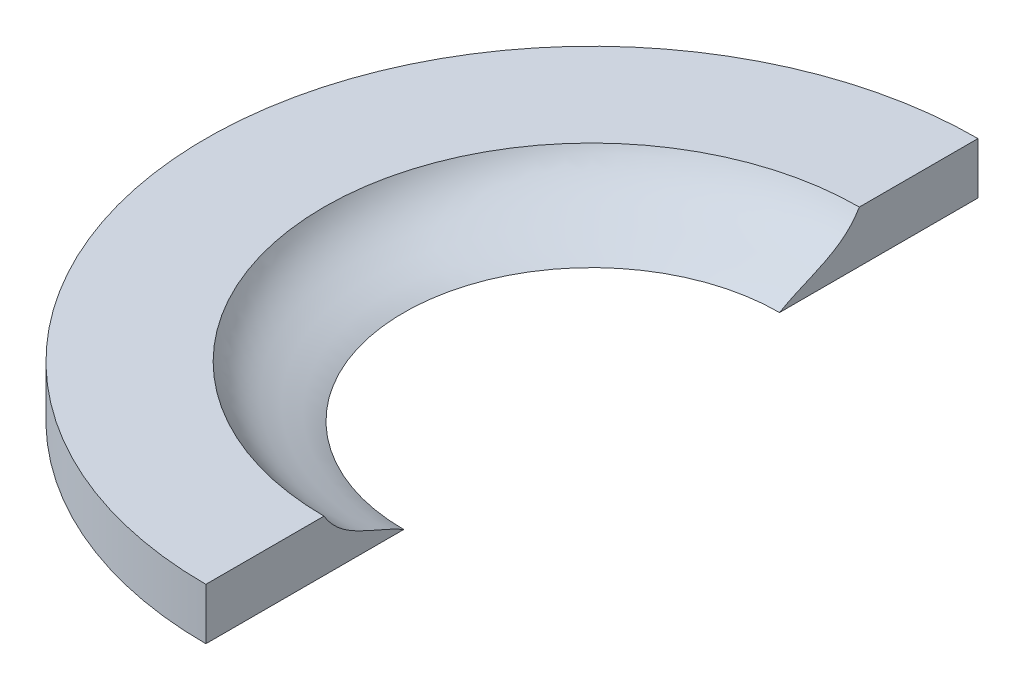
ISO-10303-21;
HEADER;
FILE_DESCRIPTION(('STEP AP214'),'2;1');
FILE_NAME('part.step','',(''),(''),'','','');
FILE_SCHEMA(('AUTOMOTIVE_DESIGN { 1 0 10303 214 1 1 1 1 }'));
ENDSEC;
DATA;
#1=APPLICATION_CONTEXT('core data for automotive mechanical design processes');
#2=APPLICATION_PROTOCOL_DEFINITION('international standard','automotive_design',2000,#1);
#3=PRODUCT_CONTEXT('',#1,'mechanical');
#4=PRODUCT('Part','Part','',(#3));
#5=PRODUCT_RELATED_PRODUCT_CATEGORY('part','',(#4));
#6=PRODUCT_DEFINITION_FORMATION('','',#4);
#7=PRODUCT_DEFINITION_CONTEXT('part definition',#1,'design');
#8=PRODUCT_DEFINITION('design','',#6,#7);
#9=PRODUCT_DEFINITION_SHAPE('','',#8);
#10=(LENGTH_UNIT() NAMED_UNIT(*) SI_UNIT(.MILLI.,.METRE.));
#11=(NAMED_UNIT(*) PLANE_ANGLE_UNIT() SI_UNIT($,.RADIAN.));
#12=(NAMED_UNIT(*) SI_UNIT($,.STERADIAN.) SOLID_ANGLE_UNIT());
#13=UNCERTAINTY_MEASURE_WITH_UNIT(LENGTH_MEASURE(1.E-05),#10,'distance_accuracy_value','');
#14=(GEOMETRIC_REPRESENTATION_CONTEXT(3) GLOBAL_UNCERTAINTY_ASSIGNED_CONTEXT((#13)) GLOBAL_UNIT_ASSIGNED_CONTEXT((#10,
#11,#12)) REPRESENTATION_CONTEXT('',''));
#15=CARTESIAN_POINT('',(0.,0.,0.));
#16=DIRECTION('',(0.,0.,1.));
#17=DIRECTION('',(1.,0.,0.));
#18=AXIS2_PLACEMENT_3D('',#15,#16,#17);
#19=CARTESIAN_POINT('',(0.,0.,0.));
#20=DIRECTION('',(0.,-1.,0.));
#21=DIRECTION('',(0.,0.,-1.));
#22=AXIS2_PLACEMENT_3D('',#19,#20,#21);
#23=PLANE('',#22);
#24=CARTESIAN_POINT('',(63.8175,0.,-63.8175));
#25=DIRECTION('',(0.,-1.,0.));
#26=DIRECTION('',(0.,0.,-1.));
#27=AXIS2_PLACEMENT_3D('',#24,#25,#26);
#28=CIRCLE('',#27,95.25);
#29=CARTESIAN_POINT('',(63.8175,0.,31.4325));
#30=VERTEX_POINT('',#29);
#31=CARTESIAN_POINT('',(63.8175,0.,-159.0675));
#32=VERTEX_POINT('',#31);
#33=EDGE_CURVE('E100',#30,#32,#28,.T.);
#34=ORIENTED_EDGE('',*,*,#33,.T.);
#35=DIRECTION('',(0.,0.,1.));
#36=VECTOR('',#35,1.);
#37=CARTESIAN_POINT('',(63.8175,0.,0.));
#38=LINE('',#37,#36);
#39=CARTESIAN_POINT('',(63.8175,0.,-110.109));
#40=VERTEX_POINT('',#39);
#41=EDGE_CURVE('E57',#32,#40,#38,.T.);
#42=ORIENTED_EDGE('',*,*,#41,.T.);
#43=CARTESIAN_POINT('',(63.8175,0.,-63.754));
#44=DIRECTION('',(0.,-1.,0.));
#45=DIRECTION('',(0.,0.,-1.));
#46=AXIS2_PLACEMENT_3D('',#43,#44,#45);
#47=CIRCLE('',#46,46.355);
#48=CARTESIAN_POINT('',(63.8175,0.,-17.399));
#49=VERTEX_POINT('',#48);
#50=EDGE_CURVE('E99',#49,#40,#47,.T.);
#51=ORIENTED_EDGE('',*,*,#50,.F.);
#52=EDGE_CURVE('E137',#49,#30,#38,.T.);
#53=ORIENTED_EDGE('',*,*,#52,.T.);
#54=EDGE_LOOP('',(#34,#42,#51,#53));
#55=FACE_BOUND('',#54,.T.);
#56=ADVANCED_FACE('F42',(#55),#23,.T.);
#57=CARTESIAN_POINT('',(0.,12.7,0.));
#58=DIRECTION('',(0.,-1.,0.));
#59=DIRECTION('',(0.,0.,-1.));
#60=AXIS2_PLACEMENT_3D('',#57,#58,#59);
#61=PLANE('',#60);
#62=DIRECTION('',(0.,0.,1.));
#63=VECTOR('',#62,1.);
#64=CARTESIAN_POINT('',(63.8175,12.7,0.));
#65=LINE('',#64,#63);
#66=CARTESIAN_POINT('',(63.8175,12.7,-159.0675));
#67=VERTEX_POINT('',#66);
#68=CARTESIAN_POINT('',(63.8175,12.7,-129.794));
#69=VERTEX_POINT('',#68);
#70=EDGE_CURVE('E81',#67,#69,#65,.T.);
#71=ORIENTED_EDGE('',*,*,#70,.F.);
#72=CARTESIAN_POINT('',(63.8175,12.7,-63.8175));
#73=DIRECTION('',(0.,-1.,0.));
#74=DIRECTION('',(0.,0.,-1.));
#75=AXIS2_PLACEMENT_3D('',#72,#73,#74);
#76=CIRCLE('',#75,95.25);
#77=CARTESIAN_POINT('',(63.8175,12.7,31.4325));
#78=VERTEX_POINT('',#77);
#79=EDGE_CURVE('E93',#67,#78,#76,.F.);
#80=ORIENTED_EDGE('',*,*,#79,.T.);
#81=CARTESIAN_POINT('',(63.8175,12.7,2.28600000000001));
#82=VERTEX_POINT('',#81);
#83=EDGE_CURVE('E65',#82,#78,#65,.T.);
#84=ORIENTED_EDGE('',*,*,#83,.F.);
#85=CARTESIAN_POINT('',(63.8175,12.7,-63.754));
#86=DIRECTION('',(0.,-1.,0.));
#87=DIRECTION('',(0.,0.,-1.));
#88=AXIS2_PLACEMENT_3D('',#85,#86,#87);
#89=CIRCLE('',#88,66.04);
#90=EDGE_CURVE('E88',#82,#69,#89,.T.);
#91=ORIENTED_EDGE('',*,*,#90,.T.);
#92=EDGE_LOOP('',(#71,#80,#84,#91));
#93=FACE_BOUND('',#92,.T.);
#94=ADVANCED_FACE('F92',(#93),#61,.F.);
#95=CARTESIAN_POINT('',(129.8575,12.7,-63.754));
#96=CARTESIAN_POINT('',(125.55672012816,5.30021060308468,-63.754));
#97=CARTESIAN_POINT('',(116.945262530909,3.99940330484602,-63.754));
#98=CARTESIAN_POINT('',(110.1725,0.,-63.754));
#99=B_SPLINE_CURVE_WITH_KNOTS('',3,(#95,#96,#97,#98),.UNSPECIFIED.,.F.,.F.,(4,4),(0.,1.),.UNSPECIFIED.);
#100=CARTESIAN_POINT('',(63.8175,-10.3301636381087,-63.754));
#101=DIRECTION('',(0.,-1.,0.));
#102=AXIS1_PLACEMENT('',#100,#101);
#103=SURFACE_OF_REVOLUTION('',#99,#102);
#104=ORIENTED_EDGE('',*,*,#90,.F.);
#105=CARTESIAN_POINT('',(63.8175,12.7,2.28600000000004));
#106=CARTESIAN_POINT('',(63.8175,5.30021060308468,-2.01477987184034));
#107=CARTESIAN_POINT('',(63.8175,3.99940330484602,-10.6262374690913));
#108=CARTESIAN_POINT('',(63.8175,0.,-17.399));
#109=B_SPLINE_CURVE_WITH_KNOTS('',3,(#105,#106,#107,#108),.UNSPECIFIED.,.F.,.F.,(4,4),(0.,1.),.UNSPECIFIED.);
#110=EDGE_CURVE('E106',#82,#49,#109,.T.);
#111=ORIENTED_EDGE('',*,*,#110,.T.);
#112=ORIENTED_EDGE('',*,*,#50,.T.);
#113=CARTESIAN_POINT('',(63.8175,12.7,-129.794));
#114=CARTESIAN_POINT('',(63.8175,5.30021060308468,-125.49322012816));
#115=CARTESIAN_POINT('',(63.8175,3.99940330484602,-116.881762530909));
#116=CARTESIAN_POINT('',(63.8175,0.,-110.109));
#117=B_SPLINE_CURVE_WITH_KNOTS('',3,(#113,#114,#115,#116),.UNSPECIFIED.,.F.,.F.,(4,4),(0.,1.),.UNSPECIFIED.);
#118=EDGE_CURVE('E143',#40,#69,#117,.F.);
#119=ORIENTED_EDGE('',*,*,#118,.T.);
#120=EDGE_LOOP('',(#104,#111,#112,#119));
#121=FACE_BOUND('',#120,.T.);
#122=ADVANCED_FACE('F121',(#121),#103,.F.);
#123=CARTESIAN_POINT('',(63.8175,282.107683632075,-63.8175));
#124=DIRECTION('',(0.,-1.,0.));
#125=DIRECTION('',(0.,0.,-1.));
#126=AXIS2_PLACEMENT_3D('',#123,#124,#125);
#127=CYLINDRICAL_SURFACE('',#126,95.25);
#128=ORIENTED_EDGE('',*,*,#33,.F.);
#129=DIRECTION('',(0.,-1.,0.));
#130=VECTOR('',#129,1.);
#131=CARTESIAN_POINT('',(63.8175,282.107683632075,31.4325));
#132=LINE('',#131,#130);
#133=EDGE_CURVE('E12',#30,#78,#132,.F.);
#134=ORIENTED_EDGE('',*,*,#133,.T.);
#135=ORIENTED_EDGE('',*,*,#79,.F.);
#136=DIRECTION('',(0.,-1.,0.));
#137=VECTOR('',#136,1.);
#138=CARTESIAN_POINT('',(63.8175,282.107683632075,-159.0675));
#139=LINE('',#138,#137);
#140=EDGE_CURVE('E50',#67,#32,#139,.T.);
#141=ORIENTED_EDGE('',*,*,#140,.T.);
#142=EDGE_LOOP('',(#128,#134,#135,#141));
#143=FACE_BOUND('',#142,.T.);
#144=ADVANCED_FACE('F97',(#143),#127,.T.);
#145=CARTESIAN_POINT('',(63.8175,0.,0.));
#146=DIRECTION('',(1.,0.,0.));
#147=DIRECTION('',(0.,0.,-1.));
#148=AXIS2_PLACEMENT_3D('',#145,#146,#147);
#149=PLANE('',#148);
#150=ORIENTED_EDGE('',*,*,#41,.F.);
#151=ORIENTED_EDGE('',*,*,#140,.F.);
#152=ORIENTED_EDGE('',*,*,#70,.T.);
#153=ORIENTED_EDGE('',*,*,#118,.F.);
#154=EDGE_LOOP('',(#150,#151,#152,#153));
#155=FACE_BOUND('',#154,.T.);
#156=ADVANCED_FACE('F80',(#155),#149,.T.);
#157=ORIENTED_EDGE('',*,*,#83,.T.);
#158=ORIENTED_EDGE('',*,*,#133,.F.);
#159=ORIENTED_EDGE('',*,*,#52,.F.);
#160=ORIENTED_EDGE('',*,*,#110,.F.);
#161=EDGE_LOOP('',(#157,#158,#159,#160));
#162=FACE_BOUND('',#161,.T.);
#163=ADVANCED_FACE('F151',(#162),#149,.T.);
#164=CLOSED_SHELL('',(#56,#94,#122,#144,#156,#163));
#165=MANIFOLD_SOLID_BREP('B2',#164);
#166=ADVANCED_BREP_SHAPE_REPRESENTATION('',(#18,#165),#14);
#167=SHAPE_DEFINITION_REPRESENTATION(#9,#166);
ENDSEC;
END-ISO-10303-21;
